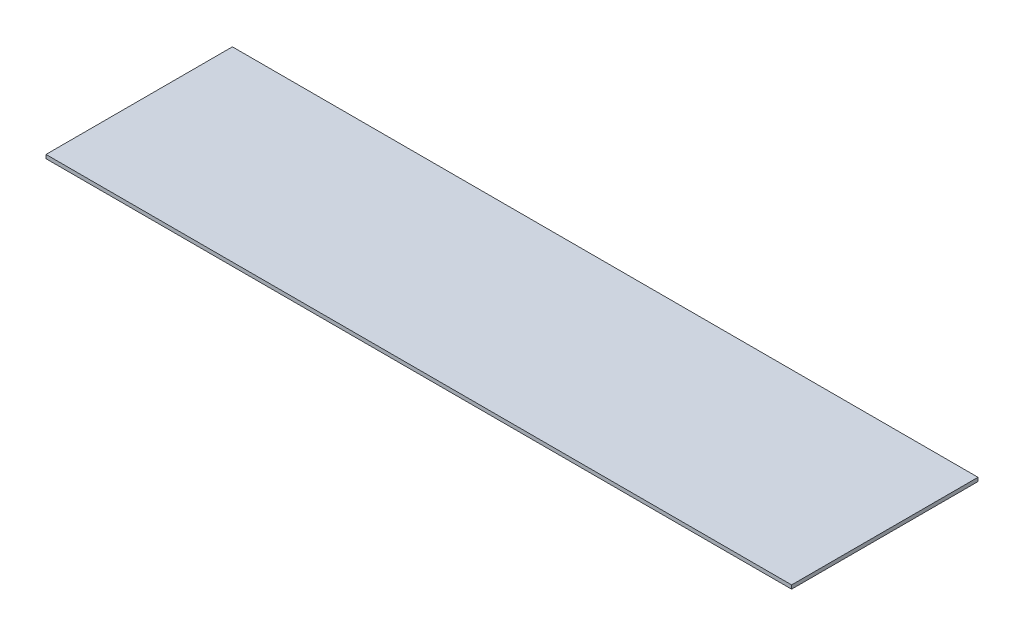
ISO-10303-21;
HEADER;
FILE_DESCRIPTION(('STEP AP214'),'2;1');
FILE_NAME('part.step','',(''),(''),'','','');
FILE_SCHEMA(('AUTOMOTIVE_DESIGN { 1 0 10303 214 1 1 1 1 }'));
ENDSEC;
DATA;
#1=APPLICATION_CONTEXT('core data for automotive mechanical design processes');
#2=APPLICATION_PROTOCOL_DEFINITION('international standard','automotive_design',2000,#1);
#3=PRODUCT_CONTEXT('',#1,'mechanical');
#4=PRODUCT('Part','Part','',(#3));
#5=PRODUCT_RELATED_PRODUCT_CATEGORY('part','',(#4));
#6=PRODUCT_DEFINITION_FORMATION('','',#4);
#7=PRODUCT_DEFINITION_CONTEXT('part definition',#1,'design');
#8=PRODUCT_DEFINITION('design','',#6,#7);
#9=PRODUCT_DEFINITION_SHAPE('','',#8);
#10=(LENGTH_UNIT() NAMED_UNIT(*) SI_UNIT(.MILLI.,.METRE.));
#11=(NAMED_UNIT(*) PLANE_ANGLE_UNIT() SI_UNIT($,.RADIAN.));
#12=(NAMED_UNIT(*) SI_UNIT($,.STERADIAN.) SOLID_ANGLE_UNIT());
#13=UNCERTAINTY_MEASURE_WITH_UNIT(LENGTH_MEASURE(1.E-05),#10,'distance_accuracy_value','');
#14=(GEOMETRIC_REPRESENTATION_CONTEXT(3) GLOBAL_UNCERTAINTY_ASSIGNED_CONTEXT((#13)) GLOBAL_UNIT_ASSIGNED_CONTEXT((#10,
#11,#12)) REPRESENTATION_CONTEXT('',''));
#15=CARTESIAN_POINT('',(0.,0.,0.));
#16=DIRECTION('',(0.,0.,1.));
#17=DIRECTION('',(1.,0.,0.));
#18=AXIS2_PLACEMENT_3D('',#15,#16,#17);
#19=CARTESIAN_POINT('',(1000.,5.,-250.));
#20=DIRECTION('',(-1.,0.,0.));
#21=DIRECTION('',(0.,0.,1.));
#22=AXIS2_PLACEMENT_3D('',#19,#20,#21);
#23=PLANE('',#22);
#24=DIRECTION('',(0.,0.,-1.));
#25=VECTOR('',#24,1.);
#26=CARTESIAN_POINT('',(1000.,-5.,-250.));
#27=LINE('',#26,#25);
#28=CARTESIAN_POINT('',(1000.,-5.,250.));
#29=VERTEX_POINT('',#28);
#30=CARTESIAN_POINT('',(1000.,-5.,-250.));
#31=VERTEX_POINT('',#30);
#32=EDGE_CURVE('E100',#29,#31,#27,.T.);
#33=ORIENTED_EDGE('',*,*,#32,.T.);
#34=DIRECTION('',(0.,-1.,0.));
#35=VECTOR('',#34,1.);
#36=CARTESIAN_POINT('',(1000.,5.,-250.));
#37=LINE('',#36,#35);
#38=CARTESIAN_POINT('',(1000.,5.,-250.));
#39=VERTEX_POINT('',#38);
#40=EDGE_CURVE('E11',#39,#31,#37,.T.);
#41=ORIENTED_EDGE('',*,*,#40,.F.);
#42=DIRECTION('',(0.,0.,-1.));
#43=VECTOR('',#42,1.);
#44=CARTESIAN_POINT('',(1000.,5.,-250.));
#45=LINE('',#44,#43);
#46=CARTESIAN_POINT('',(1000.,5.,250.));
#47=VERTEX_POINT('',#46);
#48=EDGE_CURVE('E88',#47,#39,#45,.T.);
#49=ORIENTED_EDGE('',*,*,#48,.F.);
#50=DIRECTION('',(0.,-1.,0.));
#51=VECTOR('',#50,1.);
#52=CARTESIAN_POINT('',(1000.,5.,250.));
#53=LINE('',#52,#51);
#54=EDGE_CURVE('E96',#47,#29,#53,.T.);
#55=ORIENTED_EDGE('',*,*,#54,.T.);
#56=EDGE_LOOP('',(#33,#41,#49,#55));
#57=FACE_BOUND('',#56,.T.);
#58=ADVANCED_FACE('F37',(#57),#23,.F.);
#59=CARTESIAN_POINT('',(-1000.,5.,-250.));
#60=DIRECTION('',(0.,0.,1.));
#61=DIRECTION('',(1.,0.,0.));
#62=AXIS2_PLACEMENT_3D('',#59,#60,#61);
#63=PLANE('',#62);
#64=DIRECTION('',(-1.,0.,0.));
#65=VECTOR('',#64,1.);
#66=CARTESIAN_POINT('',(-1000.,-5.,-250.));
#67=LINE('',#66,#65);
#68=CARTESIAN_POINT('',(-1000.,-5.,-250.));
#69=VERTEX_POINT('',#68);
#70=EDGE_CURVE('E92',#31,#69,#67,.T.);
#71=ORIENTED_EDGE('',*,*,#70,.T.);
#72=DIRECTION('',(0.,-1.,0.));
#73=VECTOR('',#72,1.);
#74=CARTESIAN_POINT('',(-1000.,5.,-250.));
#75=LINE('',#74,#73);
#76=CARTESIAN_POINT('',(-1000.,5.,-250.));
#77=VERTEX_POINT('',#76);
#78=EDGE_CURVE('E45',#77,#69,#75,.T.);
#79=ORIENTED_EDGE('',*,*,#78,.F.);
#80=DIRECTION('',(-1.,0.,0.));
#81=VECTOR('',#80,1.);
#82=CARTESIAN_POINT('',(-1000.,5.,-250.));
#83=LINE('',#82,#81);
#84=EDGE_CURVE('E83',#39,#77,#83,.T.);
#85=ORIENTED_EDGE('',*,*,#84,.F.);
#86=ORIENTED_EDGE('',*,*,#40,.T.);
#87=EDGE_LOOP('',(#71,#79,#85,#86));
#88=FACE_BOUND('',#87,.T.);
#89=ADVANCED_FACE('F91',(#88),#63,.F.);
#90=CARTESIAN_POINT('',(-1000.,5.,-250.));
#91=DIRECTION('',(1.,0.,0.));
#92=DIRECTION('',(0.,0.,-1.));
#93=AXIS2_PLACEMENT_3D('',#90,#91,#92);
#94=PLANE('',#93);
#95=DIRECTION('',(0.,0.,1.));
#96=VECTOR('',#95,1.);
#97=CARTESIAN_POINT('',(-1000.,-5.,-250.));
#98=LINE('',#97,#96);
#99=CARTESIAN_POINT('',(-1000.,-5.,250.));
#100=VERTEX_POINT('',#99);
#101=EDGE_CURVE('E70',#69,#100,#98,.T.);
#102=ORIENTED_EDGE('',*,*,#101,.T.);
#103=DIRECTION('',(0.,-1.,0.));
#104=VECTOR('',#103,1.);
#105=CARTESIAN_POINT('',(-1000.,5.,250.));
#106=LINE('',#105,#104);
#107=CARTESIAN_POINT('',(-1000.,5.,250.));
#108=VERTEX_POINT('',#107);
#109=EDGE_CURVE('E93',#108,#100,#106,.T.);
#110=ORIENTED_EDGE('',*,*,#109,.F.);
#111=DIRECTION('',(0.,0.,1.));
#112=VECTOR('',#111,1.);
#113=CARTESIAN_POINT('',(-1000.,5.,-250.));
#114=LINE('',#113,#112);
#115=EDGE_CURVE('E86',#77,#108,#114,.T.);
#116=ORIENTED_EDGE('',*,*,#115,.F.);
#117=ORIENTED_EDGE('',*,*,#78,.T.);
#118=EDGE_LOOP('',(#102,#110,#116,#117));
#119=FACE_BOUND('',#118,.T.);
#120=ADVANCED_FACE('F94',(#119),#94,.F.);
#121=CARTESIAN_POINT('',(-1000.,5.,250.));
#122=DIRECTION('',(0.,0.,-1.));
#123=DIRECTION('',(-1.,0.,0.));
#124=AXIS2_PLACEMENT_3D('',#121,#122,#123);
#125=PLANE('',#124);
#126=DIRECTION('',(1.,0.,0.));
#127=VECTOR('',#126,1.);
#128=CARTESIAN_POINT('',(-1000.,-5.,250.));
#129=LINE('',#128,#127);
#130=EDGE_CURVE('E76',#100,#29,#129,.T.);
#131=ORIENTED_EDGE('',*,*,#130,.T.);
#132=ORIENTED_EDGE('',*,*,#54,.F.);
#133=DIRECTION('',(1.,0.,0.));
#134=VECTOR('',#133,1.);
#135=CARTESIAN_POINT('',(-1000.,5.,250.));
#136=LINE('',#135,#134);
#137=EDGE_CURVE('E53',#108,#47,#136,.T.);
#138=ORIENTED_EDGE('',*,*,#137,.F.);
#139=ORIENTED_EDGE('',*,*,#109,.T.);
#140=EDGE_LOOP('',(#131,#132,#138,#139));
#141=FACE_BOUND('',#140,.T.);
#142=ADVANCED_FACE('F107',(#141),#125,.F.);
#143=CARTESIAN_POINT('',(0.,5.,0.));
#144=DIRECTION('',(0.,1.,0.));
#145=DIRECTION('',(0.,0.,1.));
#146=AXIS2_PLACEMENT_3D('',#143,#144,#145);
#147=PLANE('',#146);
#148=ORIENTED_EDGE('',*,*,#48,.T.);
#149=ORIENTED_EDGE('',*,*,#84,.T.);
#150=ORIENTED_EDGE('',*,*,#115,.T.);
#151=ORIENTED_EDGE('',*,*,#137,.T.);
#152=EDGE_LOOP('',(#148,#149,#150,#151));
#153=FACE_BOUND('',#152,.T.);
#154=ADVANCED_FACE('F84',(#153),#147,.T.);
#155=CARTESIAN_POINT('',(0.,-5.,0.));
#156=DIRECTION('',(0.,1.,0.));
#157=DIRECTION('',(0.,0.,1.));
#158=AXIS2_PLACEMENT_3D('',#155,#156,#157);
#159=PLANE('',#158);
#160=ORIENTED_EDGE('',*,*,#32,.F.);
#161=ORIENTED_EDGE('',*,*,#130,.F.);
#162=ORIENTED_EDGE('',*,*,#101,.F.);
#163=ORIENTED_EDGE('',*,*,#70,.F.);
#164=EDGE_LOOP('',(#160,#161,#162,#163));
#165=FACE_BOUND('',#164,.T.);
#166=ADVANCED_FACE('F110',(#165),#159,.F.);
#167=CLOSED_SHELL('',(#58,#89,#120,#142,#154,#166));
#168=MANIFOLD_SOLID_BREP('B2',#167);
#169=ADVANCED_BREP_SHAPE_REPRESENTATION('',(#18,#168),#14);
#170=SHAPE_DEFINITION_REPRESENTATION(#9,#169);
ENDSEC;
END-ISO-10303-21;
